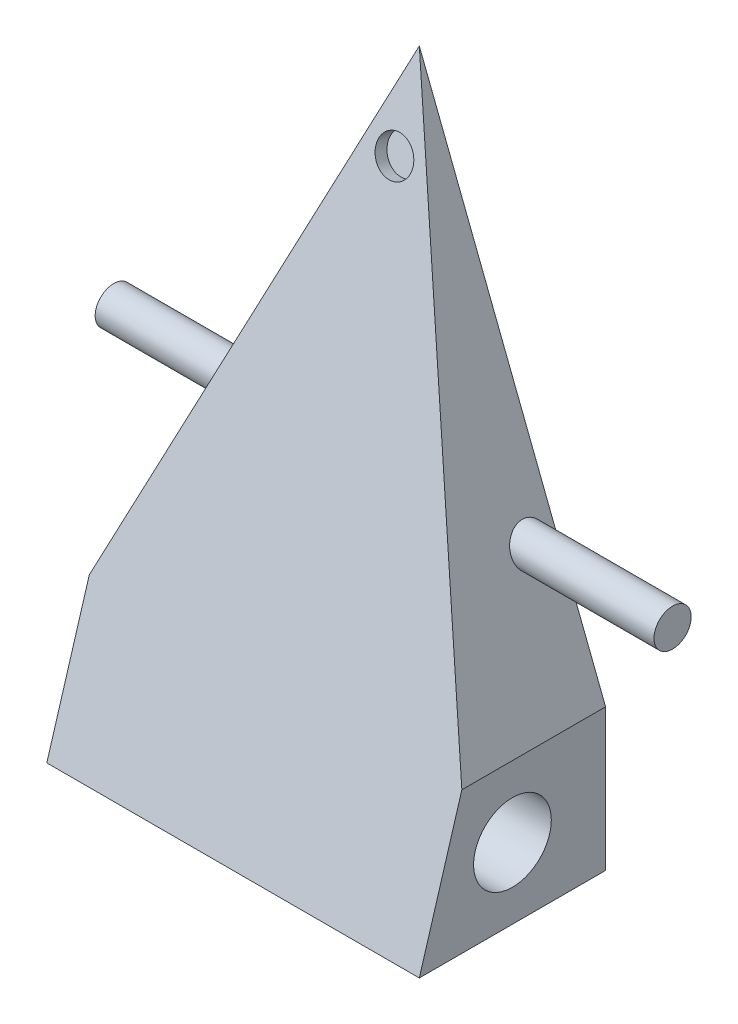
ISO-10303-21;
HEADER;
FILE_DESCRIPTION(('STEP AP214'),'2;1');
FILE_NAME('part.step','',(''),(''),'','','');
FILE_SCHEMA(('AUTOMOTIVE_DESIGN { 1 0 10303 214 1 1 1 1 }'));
ENDSEC;
DATA;
#1=APPLICATION_CONTEXT('core data for automotive mechanical design processes');
#2=APPLICATION_PROTOCOL_DEFINITION('international standard','automotive_design',2000,#1);
#3=PRODUCT_CONTEXT('',#1,'mechanical');
#4=PRODUCT('Part','Part','',(#3));
#5=PRODUCT_RELATED_PRODUCT_CATEGORY('part','',(#4));
#6=PRODUCT_DEFINITION_FORMATION('','',#4);
#7=PRODUCT_DEFINITION_CONTEXT('part definition',#1,'design');
#8=PRODUCT_DEFINITION('design','',#6,#7);
#9=PRODUCT_DEFINITION_SHAPE('','',#8);
#10=(LENGTH_UNIT() NAMED_UNIT(*) SI_UNIT(.MILLI.,.METRE.));
#11=(NAMED_UNIT(*) PLANE_ANGLE_UNIT() SI_UNIT($,.RADIAN.));
#12=(NAMED_UNIT(*) SI_UNIT($,.STERADIAN.) SOLID_ANGLE_UNIT());
#13=UNCERTAINTY_MEASURE_WITH_UNIT(LENGTH_MEASURE(1.E-05),#10,'distance_accuracy_value','');
#14=(GEOMETRIC_REPRESENTATION_CONTEXT(3) GLOBAL_UNCERTAINTY_ASSIGNED_CONTEXT((#13)) GLOBAL_UNIT_ASSIGNED_CONTEXT((#10,
#11,#12)) REPRESENTATION_CONTEXT('',''));
#15=CARTESIAN_POINT('',(0.,0.,0.));
#16=DIRECTION('',(0.,0.,1.));
#17=DIRECTION('',(1.,0.,0.));
#18=AXIS2_PLACEMENT_3D('',#15,#16,#17);
#19=CARTESIAN_POINT('',(60.,-36.5125,-30.));
#20=DIRECTION('',(0.,0.,1.));
#21=DIRECTION('',(1.,0.,0.));
#22=AXIS2_PLACEMENT_3D('',#19,#20,#21);
#23=PLANE('',#22);
#24=DIRECTION('',(0.,1.,0.));
#25=VECTOR('',#24,1.);
#26=CARTESIAN_POINT('',(0.,-36.5125,-30.));
#27=LINE('',#26,#25);
#28=CARTESIAN_POINT('',(0.,-36.5125,-30.));
#29=VERTEX_POINT('',#28);
#30=CARTESIAN_POINT('',(0.,-13.6841289089773,-30.));
#31=VERTEX_POINT('',#30);
#32=EDGE_CURVE('E90',#29,#31,#27,.T.);
#33=ORIENTED_EDGE('',*,*,#32,.T.);
#34=DIRECTION('',(-0.362328874004587,-0.932050313589652,0.));
#35=VECTOR('',#34,1.);
#36=CARTESIAN_POINT('',(0.,-13.6841289089773,-30.));
#37=LINE('',#36,#35);
#38=CARTESIAN_POINT('',(30.,63.4875,-30.));
#39=VERTEX_POINT('',#38);
#40=EDGE_CURVE('E76',#39,#31,#37,.T.);
#41=ORIENTED_EDGE('',*,*,#40,.F.);
#42=DIRECTION('',(-0.362328874004587,0.932050313589652,0.));
#43=VECTOR('',#42,1.);
#44=CARTESIAN_POINT('',(30.,63.4875,-30.));
#45=LINE('',#44,#43);
#46=CARTESIAN_POINT('',(60.,-13.6841289089773,-30.));
#47=VERTEX_POINT('',#46);
#48=EDGE_CURVE('E167',#47,#39,#45,.T.);
#49=ORIENTED_EDGE('',*,*,#48,.F.);
#50=DIRECTION('',(0.,1.,0.));
#51=VECTOR('',#50,1.);
#52=CARTESIAN_POINT('',(60.,-36.5125,-30.));
#53=LINE('',#52,#51);
#54=CARTESIAN_POINT('',(60.,-36.5125,-30.));
#55=VERTEX_POINT('',#54);
#56=EDGE_CURVE('E95',#55,#47,#53,.T.);
#57=ORIENTED_EDGE('',*,*,#56,.F.);
#58=DIRECTION('',(-1.,0.,0.));
#59=VECTOR('',#58,1.);
#60=CARTESIAN_POINT('',(60.,-36.5125,-30.));
#61=LINE('',#60,#59);
#62=EDGE_CURVE('E57',#55,#29,#61,.T.);
#63=ORIENTED_EDGE('',*,*,#62,.T.);
#64=EDGE_LOOP('',(#33,#41,#49,#57,#63));
#65=FACE_BOUND('',#64,.T.);
#66=ADVANCED_FACE('F33',(#65),#23,.F.);
#67=CARTESIAN_POINT('',(60.,-36.5125,-30.));
#68=DIRECTION('',(0.,-1.,0.));
#69=DIRECTION('',(0.,0.,-1.));
#70=AXIS2_PLACEMENT_3D('',#67,#68,#69);
#71=PLANE('',#70);
#72=DIRECTION('',(0.,0.,1.));
#73=VECTOR('',#72,1.);
#74=CARTESIAN_POINT('',(0.,-36.5125,-30.));
#75=LINE('',#74,#73);
#76=CARTESIAN_POINT('',(0.,-36.5125,0.));
#77=VERTEX_POINT('',#76);
#78=EDGE_CURVE('E93',#29,#77,#75,.T.);
#79=ORIENTED_EDGE('',*,*,#78,.F.);
#80=ORIENTED_EDGE('',*,*,#62,.F.);
#81=DIRECTION('',(0.,0.,1.));
#82=VECTOR('',#81,1.);
#83=CARTESIAN_POINT('',(60.,-36.5125,-30.));
#84=LINE('',#83,#82);
#85=CARTESIAN_POINT('',(60.,-36.5125,0.));
#86=VERTEX_POINT('',#85);
#87=EDGE_CURVE('E100',#55,#86,#84,.T.);
#88=ORIENTED_EDGE('',*,*,#87,.T.);
#89=DIRECTION('',(-1.,0.,0.));
#90=VECTOR('',#89,1.);
#91=CARTESIAN_POINT('',(60.,-36.5125,0.));
#92=LINE('',#91,#90);
#93=EDGE_CURVE('E104',#86,#77,#92,.T.);
#94=ORIENTED_EDGE('',*,*,#93,.T.);
#95=EDGE_LOOP('',(#79,#80,#88,#94));
#96=FACE_BOUND('',#95,.T.);
#97=ADVANCED_FACE('F130',(#96),#71,.T.);
#98=CARTESIAN_POINT('',(60.,0.,0.));
#99=DIRECTION('',(-1.,0.,0.));
#100=DIRECTION('',(0.,0.,1.));
#101=AXIS2_PLACEMENT_3D('',#98,#99,#100);
#102=PLANE('',#101);
#103=CARTESIAN_POINT('',(60.,-25.0983144544887,-15.));
#104=DIRECTION('',(1.,0.,0.));
#105=DIRECTION('',(0.,0.,-1.));
#106=AXIS2_PLACEMENT_3D('',#103,#104,#105);
#107=CIRCLE('',#106,6.25778441560549);
#108=CARTESIAN_POINT('',(60.,-25.0983144544887,-21.2577844156055));
#109=VERTEX_POINT('',#108);
#110=EDGE_CURVE('E156',#109,#109,#107,.T.);
#111=ORIENTED_EDGE('',*,*,#110,.F.);
#112=EDGE_LOOP('',(#111));
#113=FACE_BOUND('',#112,.T.);
#114=ORIENTED_EDGE('',*,*,#56,.T.);
#115=DIRECTION('',(0.,0.,-1.));
#116=VECTOR('',#115,1.);
#117=CARTESIAN_POINT('',(60.,-13.6841289089773,30.));
#118=LINE('',#117,#116);
#119=CARTESIAN_POINT('',(60.,-13.6841289089773,-6.84851132730681));
#120=VERTEX_POINT('',#119);
#121=EDGE_CURVE('E169',#120,#47,#118,.T.);
#122=ORIENTED_EDGE('',*,*,#121,.F.);
#123=DIRECTION('',(0.,0.957826285221151,-0.287347885566345));
#124=VECTOR('',#123,1.);
#125=CARTESIAN_POINT('',(60.,-36.5125,0.));
#126=LINE('',#125,#124);
#127=EDGE_CURVE('E97',#86,#120,#126,.T.);
#128=ORIENTED_EDGE('',*,*,#127,.F.);
#129=ORIENTED_EDGE('',*,*,#87,.F.);
#130=EDGE_LOOP('',(#114,#122,#128,#129));
#131=FACE_BOUND('',#130,.T.);
#132=ADVANCED_FACE('F134',(#113,#131),#102,.F.);
#133=CARTESIAN_POINT('',(0.,0.,0.));
#134=DIRECTION('',(-1.,0.,0.));
#135=DIRECTION('',(0.,0.,1.));
#136=AXIS2_PLACEMENT_3D('',#133,#134,#135);
#137=PLANE('',#136);
#138=CARTESIAN_POINT('',(0.,-25.0983144544887,-15.));
#139=DIRECTION('',(1.,0.,0.));
#140=DIRECTION('',(0.,0.,-1.));
#141=AXIS2_PLACEMENT_3D('',#138,#139,#140);
#142=CIRCLE('',#141,6.25778441560549);
#143=CARTESIAN_POINT('',(0.,-25.0983144544887,-21.2577844156055));
#144=VERTEX_POINT('',#143);
#145=EDGE_CURVE('E83',#144,#144,#142,.T.);
#146=ORIENTED_EDGE('',*,*,#145,.T.);
#147=EDGE_LOOP('',(#146));
#148=FACE_BOUND('',#147,.T.);
#149=DIRECTION('',(0.,0.,-1.));
#150=VECTOR('',#149,1.);
#151=CARTESIAN_POINT('',(0.,-13.6841289089773,30.));
#152=LINE('',#151,#150);
#153=CARTESIAN_POINT('',(0.,-13.6841289089773,-6.84851132730681));
#154=VERTEX_POINT('',#153);
#155=EDGE_CURVE('E48',#154,#31,#152,.T.);
#156=ORIENTED_EDGE('',*,*,#155,.T.);
#157=ORIENTED_EDGE('',*,*,#32,.F.);
#158=ORIENTED_EDGE('',*,*,#78,.T.);
#159=DIRECTION('',(0.,0.957826285221151,-0.287347885566345));
#160=VECTOR('',#159,1.);
#161=CARTESIAN_POINT('',(0.,-36.5125,0.));
#162=LINE('',#161,#160);
#163=EDGE_CURVE('E91',#77,#154,#162,.T.);
#164=ORIENTED_EDGE('',*,*,#163,.T.);
#165=EDGE_LOOP('',(#156,#157,#158,#164));
#166=FACE_BOUND('',#165,.T.);
#167=ADVANCED_FACE('F88',(#148,#166),#137,.T.);
#168=CARTESIAN_POINT('',(0.,-36.5125,0.));
#169=DIRECTION('',(0.,-0.287347885566345,-0.957826285221151));
#170=DIRECTION('',(0.,0.957826285221151,-0.287347885566345));
#171=AXIS2_PLACEMENT_3D('',#168,#169,#170);
#172=PLANE('',#171);
#173=CARTESIAN_POINT('',(30.,50.1312072628856,-25.9931121788657));
#174=DIRECTION('',(0.,0.287347885566345,0.957826285221151));
#175=DIRECTION('',(0.,-0.957826285221151,0.287347885566345));
#176=AXIS2_PLACEMENT_3D('',#173,#174,#175);
#177=CIRCLE('',#176,3.);
#178=CARTESIAN_POINT('',(30.,47.2577284072222,-25.1310685221667));
#179=VERTEX_POINT('',#178);
#180=EDGE_CURVE('E150',#179,#179,#177,.T.);
#181=ORIENTED_EDGE('',*,*,#180,.F.);
#182=EDGE_LOOP('',(#181));
#183=FACE_BOUND('',#182,.T.);
#184=DIRECTION('',(-0.348944519726442,0.897620566205011,-0.269286169861503));
#185=VECTOR('',#184,1.);
#186=CARTESIAN_POINT('',(60.4880873980238,-14.9396788941587,-6.47184633175239));
#187=LINE('',#186,#185);
#188=EDGE_CURVE('E106',#120,#39,#187,.T.);
#189=ORIENTED_EDGE('',*,*,#188,.T.);
#190=DIRECTION('',(-0.348944519726443,-0.897620566205011,0.269286169861503));
#191=VECTOR('',#190,1.);
#192=CARTESIAN_POINT('',(-7.79382406885087,-33.7328655364178,-0.833890339074665));
#193=LINE('',#192,#191);
#194=EDGE_CURVE('E78',#39,#154,#193,.T.);
#195=ORIENTED_EDGE('',*,*,#194,.T.);
#196=ORIENTED_EDGE('',*,*,#163,.F.);
#197=ORIENTED_EDGE('',*,*,#93,.F.);
#198=ORIENTED_EDGE('',*,*,#127,.T.);
#199=EDGE_LOOP('',(#189,#195,#196,#197,#198));
#200=FACE_BOUND('',#199,.T.);
#201=ADVANCED_FACE('F126',(#183,#200),#172,.F.);
#202=CARTESIAN_POINT('',(30.,63.4875,30.));
#203=DIRECTION('',(-0.932050313589652,-0.362328874004587,0.));
#204=DIRECTION('',(0.362328874004587,-0.932050313589652,0.));
#205=AXIS2_PLACEMENT_3D('',#202,#203,#204);
#206=PLANE('',#205);
#207=CARTESIAN_POINT('',(51.9715846534132,6.96806741948725,-25.790784960849));
#208=DIRECTION('',(-0.932050313589652,-0.362328874004587,0.));
#209=DIRECTION('',(-0.362328874004587,0.932050313589652,0.));
#210=AXIS2_PLACEMENT_3D('',#207,#208,#209);
#211=ELLIPSE('',#210,3.21871035957914,3.);
#212=CARTESIAN_POINT('',(50.80535295308,9.96806741948725,-25.790784960849));
#213=VERTEX_POINT('',#212);
#214=EDGE_CURVE('E11',#213,#213,#211,.F.);
#215=ORIENTED_EDGE('',*,*,#214,.F.);
#216=EDGE_LOOP('',(#215));
#217=FACE_BOUND('',#216,.T.);
#218=ORIENTED_EDGE('',*,*,#121,.T.);
#219=ORIENTED_EDGE('',*,*,#48,.T.);
#220=ORIENTED_EDGE('',*,*,#188,.F.);
#221=EDGE_LOOP('',(#218,#219,#220));
#222=FACE_BOUND('',#221,.T.);
#223=ADVANCED_FACE('F117',(#217,#222),#206,.F.);
#224=CARTESIAN_POINT('',(0.,-13.6841289089773,30.));
#225=DIRECTION('',(0.932050313589652,-0.362328874004587,0.));
#226=DIRECTION('',(0.362328874004587,0.932050313589652,0.));
#227=AXIS2_PLACEMENT_3D('',#224,#225,#226);
#228=PLANE('',#227);
#229=CARTESIAN_POINT('',(8.02841534658683,6.96806741948725,-25.790784960849));
#230=DIRECTION('',(0.932050313589652,-0.362328874004587,0.));
#231=DIRECTION('',(-0.362328874004587,-0.932050313589652,0.));
#232=AXIS2_PLACEMENT_3D('',#229,#230,#231);
#233=ELLIPSE('',#232,3.21871035957914,3.);
#234=CARTESIAN_POINT('',(6.86218364625362,3.96806741948724,-25.790784960849));
#235=VERTEX_POINT('',#234);
#236=EDGE_CURVE('E36',#235,#235,#233,.F.);
#237=ORIENTED_EDGE('',*,*,#236,.F.);
#238=EDGE_LOOP('',(#237));
#239=FACE_BOUND('',#238,.T.);
#240=ORIENTED_EDGE('',*,*,#40,.T.);
#241=ORIENTED_EDGE('',*,*,#155,.F.);
#242=ORIENTED_EDGE('',*,*,#194,.F.);
#243=EDGE_LOOP('',(#240,#241,#242));
#244=FACE_BOUND('',#243,.T.);
#245=ADVANCED_FACE('F77',(#239,#244),#228,.F.);
#246=CARTESIAN_POINT('',(0.,-25.0983144544887,-15.));
#247=DIRECTION('',(1.,0.,0.));
#248=DIRECTION('',(0.,0.,-1.));
#249=AXIS2_PLACEMENT_3D('',#246,#247,#248);
#250=CYLINDRICAL_SURFACE('',#249,6.25778441560549);
#251=ORIENTED_EDGE('',*,*,#145,.F.);
#252=EDGE_LOOP('',(#251));
#253=FACE_BOUND('',#252,.T.);
#254=ORIENTED_EDGE('',*,*,#110,.T.);
#255=EDGE_LOOP('',(#254));
#256=FACE_BOUND('',#255,.T.);
#257=ADVANCED_FACE('F116',(#253,#256),#250,.F.);
#258=CARTESIAN_POINT('',(30.,49.5565114917529,-27.908764749308));
#259=DIRECTION('',(0.,0.287347885566345,0.957826285221151));
#260=DIRECTION('',(0.,-0.957826285221151,0.287347885566345));
#261=AXIS2_PLACEMENT_3D('',#258,#259,#260);
#262=CYLINDRICAL_SURFACE('',#261,3.);
#263=CARTESIAN_POINT('',(30.,49.5565114917529,-27.908764749308));
#264=DIRECTION('',(0.,0.287347885566345,0.957826285221151));
#265=DIRECTION('',(0.,-0.957826285221151,0.287347885566345));
#266=AXIS2_PLACEMENT_3D('',#263,#264,#265);
#267=CIRCLE('',#266,3.);
#268=CARTESIAN_POINT('',(30.,46.6830326360895,-27.046721092609));
#269=VERTEX_POINT('',#268);
#270=EDGE_CURVE('E152',#269,#269,#267,.T.);
#271=ORIENTED_EDGE('',*,*,#270,.F.);
#272=EDGE_LOOP('',(#271));
#273=FACE_BOUND('',#272,.T.);
#274=ORIENTED_EDGE('',*,*,#180,.T.);
#275=EDGE_LOOP('',(#274));
#276=FACE_BOUND('',#275,.T.);
#277=ADVANCED_FACE('F123',(#273,#276),#262,.F.);
#278=CARTESIAN_POINT('',(30.,49.5565114917529,-27.908764749308));
#279=DIRECTION('',(0.,0.287347885566345,0.957826285221151));
#280=DIRECTION('',(0.,-0.957826285221151,0.287347885566345));
#281=AXIS2_PLACEMENT_3D('',#278,#279,#280);
#282=PLANE('',#281);
#283=ORIENTED_EDGE('',*,*,#270,.T.);
#284=EDGE_LOOP('',(#283));
#285=FACE_BOUND('',#284,.T.);
#286=ADVANCED_FACE('F187',(#285),#282,.T.);
#287=CARTESIAN_POINT('',(-15.,6.96806741948725,-25.790784960849));
#288=DIRECTION('',(1.,0.,0.));
#289=DIRECTION('',(0.,0.,-1.));
#290=AXIS2_PLACEMENT_3D('',#287,#288,#289);
#291=PLANE('',#290);
#292=CARTESIAN_POINT('',(-15.,6.96806741948725,-25.790784960849));
#293=DIRECTION('',(1.,0.,0.));
#294=DIRECTION('',(0.,0.,-1.));
#295=AXIS2_PLACEMENT_3D('',#292,#293,#294);
#296=CIRCLE('',#295,3.);
#297=CARTESIAN_POINT('',(-15.,6.96806741948725,-28.7907849608491));
#298=VERTEX_POINT('',#297);
#299=EDGE_CURVE('E159',#298,#298,#296,.T.);
#300=ORIENTED_EDGE('',*,*,#299,.F.);
#301=EDGE_LOOP('',(#300));
#302=FACE_BOUND('',#301,.T.);
#303=ADVANCED_FACE('F185',(#302),#291,.F.);
#304=CARTESIAN_POINT('',(75.,6.96806741948725,-25.790784960849));
#305=DIRECTION('',(-1.,0.,0.));
#306=DIRECTION('',(0.,0.,1.));
#307=AXIS2_PLACEMENT_3D('',#304,#305,#306);
#308=CYLINDRICAL_SURFACE('',#307,3.);
#309=ORIENTED_EDGE('',*,*,#299,.T.);
#310=EDGE_LOOP('',(#309));
#311=FACE_BOUND('',#310,.T.);
#312=ORIENTED_EDGE('',*,*,#236,.T.);
#313=EDGE_LOOP('',(#312));
#314=FACE_BOUND('',#313,.T.);
#315=ADVANCED_FACE('F113',(#311,#314),#308,.T.);
#316=CARTESIAN_POINT('',(75.,6.96806741948725,-25.790784960849));
#317=DIRECTION('',(1.,0.,0.));
#318=DIRECTION('',(0.,0.,-1.));
#319=AXIS2_PLACEMENT_3D('',#316,#317,#318);
#320=CIRCLE('',#319,3.);
#321=CARTESIAN_POINT('',(75.,6.96806741948725,-28.7907849608491));
#322=VERTEX_POINT('',#321);
#323=EDGE_CURVE('E153',#322,#322,#320,.T.);
#324=ORIENTED_EDGE('',*,*,#323,.F.);
#325=EDGE_LOOP('',(#324));
#326=FACE_BOUND('',#325,.T.);
#327=ORIENTED_EDGE('',*,*,#214,.T.);
#328=EDGE_LOOP('',(#327));
#329=FACE_BOUND('',#328,.T.);
#330=ADVANCED_FACE('F193',(#326,#329),#308,.T.);
#331=CARTESIAN_POINT('',(75.,6.96806741948725,-25.790784960849));
#332=DIRECTION('',(1.,0.,0.));
#333=DIRECTION('',(0.,0.,-1.));
#334=AXIS2_PLACEMENT_3D('',#331,#332,#333);
#335=PLANE('',#334);
#336=ORIENTED_EDGE('',*,*,#323,.T.);
#337=EDGE_LOOP('',(#336));
#338=FACE_BOUND('',#337,.T.);
#339=ADVANCED_FACE('F198',(#338),#335,.T.);
#340=CLOSED_SHELL('',(#66,#97,#132,#167,#201,#223,#245,#257,#277,#286,#303,#315,#330,#339));
#341=MANIFOLD_SOLID_BREP('B2',#340);
#342=ADVANCED_BREP_SHAPE_REPRESENTATION('',(#18,#341),#14);
#343=SHAPE_DEFINITION_REPRESENTATION(#9,#342);
ENDSEC;
END-ISO-10303-21;
